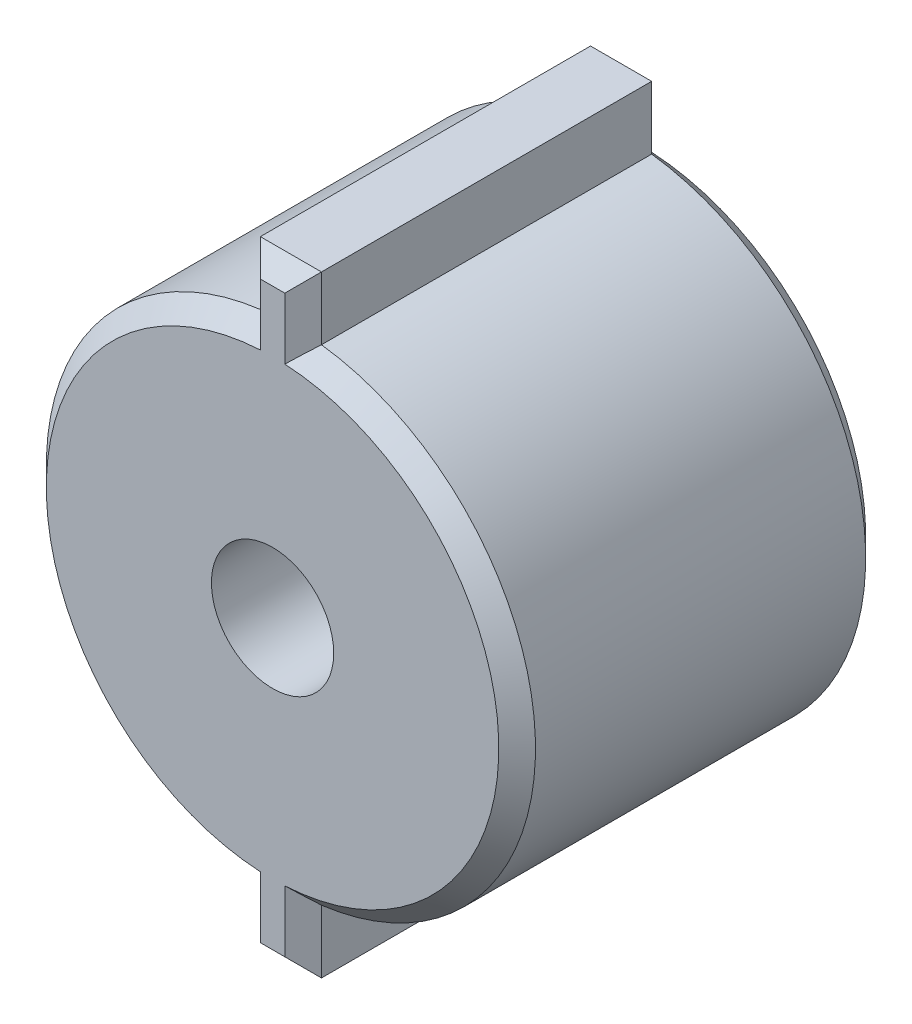
ISO-10303-21;
HEADER;
FILE_DESCRIPTION(('STEP AP214'),'2;1');
FILE_NAME('part.step','',(''),(''),'','','');
FILE_SCHEMA(('AUTOMOTIVE_DESIGN { 1 0 10303 214 1 1 1 1 }'));
ENDSEC;
DATA;
#1=APPLICATION_CONTEXT('core data for automotive mechanical design processes');
#2=APPLICATION_PROTOCOL_DEFINITION('international standard','automotive_design',2000,#1);
#3=PRODUCT_CONTEXT('',#1,'mechanical');
#4=PRODUCT('Part','Part','',(#3));
#5=PRODUCT_RELATED_PRODUCT_CATEGORY('part','',(#4));
#6=PRODUCT_DEFINITION_FORMATION('','',#4);
#7=PRODUCT_DEFINITION_CONTEXT('part definition',#1,'design');
#8=PRODUCT_DEFINITION('design','',#6,#7);
#9=PRODUCT_DEFINITION_SHAPE('','',#8);
#10=(LENGTH_UNIT() NAMED_UNIT(*) SI_UNIT(.MILLI.,.METRE.));
#11=(NAMED_UNIT(*) PLANE_ANGLE_UNIT() SI_UNIT($,.RADIAN.));
#12=(NAMED_UNIT(*) SI_UNIT($,.STERADIAN.) SOLID_ANGLE_UNIT());
#13=UNCERTAINTY_MEASURE_WITH_UNIT(LENGTH_MEASURE(1.E-05),#10,'distance_accuracy_value','');
#14=(GEOMETRIC_REPRESENTATION_CONTEXT(3) GLOBAL_UNCERTAINTY_ASSIGNED_CONTEXT((#13)) GLOBAL_UNIT_ASSIGNED_CONTEXT((#10,
#11,#12)) REPRESENTATION_CONTEXT('',''));
#15=CARTESIAN_POINT('',(0.,0.,0.));
#16=DIRECTION('',(0.,0.,1.));
#17=DIRECTION('',(1.,0.,0.));
#18=AXIS2_PLACEMENT_3D('',#15,#16,#17);
#19=CARTESIAN_POINT('',(0.,0.,1.5));
#20=DIRECTION('',(0.,0.,-1.));
#21=DIRECTION('',(-1.,0.,0.));
#22=AXIS2_PLACEMENT_3D('',#19,#20,#21);
#23=CYLINDRICAL_SURFACE('',#22,2.);
#24=DIRECTION('',(0.,0.,-1.));
#25=VECTOR('',#24,1.);
#26=CARTESIAN_POINT('',(-0.25,1.98431348329844,1.5));
#27=LINE('',#26,#25);
#28=CARTESIAN_POINT('',(-0.25,1.98431348329844,1.35));
#29=VERTEX_POINT('',#28);
#30=CARTESIAN_POINT('',(-0.25,1.98431348329844,-1.35));
#31=VERTEX_POINT('',#30);
#32=EDGE_CURVE('E472',#29,#31,#27,.T.);
#33=ORIENTED_EDGE('',*,*,#32,.T.);
#34=CARTESIAN_POINT('',(0.,0.,-1.35));
#35=DIRECTION('',(0.,0.,1.));
#36=DIRECTION('',(1.,0.,0.));
#37=AXIS2_PLACEMENT_3D('',#34,#35,#36);
#38=CIRCLE('',#37,2.);
#39=CARTESIAN_POINT('',(-0.25,-1.98431348329844,-1.35));
#40=VERTEX_POINT('',#39);
#41=EDGE_CURVE('E213',#31,#40,#38,.T.);
#42=ORIENTED_EDGE('',*,*,#41,.T.);
#43=DIRECTION('',(0.,0.,-1.));
#44=VECTOR('',#43,1.);
#45=CARTESIAN_POINT('',(-0.25,-1.98431348329844,1.5));
#46=LINE('',#45,#44);
#47=CARTESIAN_POINT('',(-0.25,-1.98431348329844,1.35));
#48=VERTEX_POINT('',#47);
#49=EDGE_CURVE('E171',#48,#40,#46,.T.);
#50=ORIENTED_EDGE('',*,*,#49,.F.);
#51=CARTESIAN_POINT('',(0.,0.,1.35));
#52=DIRECTION('',(0.,0.,1.));
#53=DIRECTION('',(1.,0.,0.));
#54=AXIS2_PLACEMENT_3D('',#51,#52,#53);
#55=CIRCLE('',#54,2.);
#56=EDGE_CURVE('E211',#48,#29,#55,.F.);
#57=ORIENTED_EDGE('',*,*,#56,.T.);
#58=EDGE_LOOP('',(#33,#42,#50,#57));
#59=FACE_BOUND('',#58,.T.);
#60=ADVANCED_FACE('F37',(#59),#23,.T.);
#61=CARTESIAN_POINT('',(-0.25,0.,1.5));
#62=DIRECTION('',(-1.,0.,0.));
#63=DIRECTION('',(0.,0.,1.));
#64=AXIS2_PLACEMENT_3D('',#61,#62,#63);
#65=PLANE('',#64);
#66=ORIENTED_EDGE('',*,*,#49,.T.);
#67=DIRECTION('',(0.,-1.,0.));
#68=VECTOR('',#67,1.);
#69=CARTESIAN_POINT('',(-0.25,-2.5,-1.35));
#70=LINE('',#69,#68);
#71=CARTESIAN_POINT('',(-0.25,-2.5,-1.35));
#72=VERTEX_POINT('',#71);
#73=EDGE_CURVE('E158',#40,#72,#70,.T.);
#74=ORIENTED_EDGE('',*,*,#73,.T.);
#75=DIRECTION('',(0.,0.,-1.));
#76=VECTOR('',#75,1.);
#77=CARTESIAN_POINT('',(-0.25,-2.5,1.5));
#78=LINE('',#77,#76);
#79=CARTESIAN_POINT('',(-0.25,-2.5,1.35));
#80=VERTEX_POINT('',#79);
#81=EDGE_CURVE('E413',#80,#72,#78,.T.);
#82=ORIENTED_EDGE('',*,*,#81,.F.);
#83=DIRECTION('',(0.,1.,0.));
#84=VECTOR('',#83,1.);
#85=CARTESIAN_POINT('',(-0.25,0.,1.35));
#86=LINE('',#85,#84);
#87=EDGE_CURVE('E178',#80,#48,#86,.T.);
#88=ORIENTED_EDGE('',*,*,#87,.T.);
#89=EDGE_LOOP('',(#66,#74,#82,#88));
#90=FACE_BOUND('',#89,.T.);
#91=ADVANCED_FACE('F416',(#90),#65,.T.);
#92=CARTESIAN_POINT('',(0.,-2.5,1.5));
#93=DIRECTION('',(0.,-1.,0.));
#94=DIRECTION('',(0.,0.,-1.));
#95=AXIS2_PLACEMENT_3D('',#92,#93,#94);
#96=PLANE('',#95);
#97=ORIENTED_EDGE('',*,*,#81,.T.);
#98=DIRECTION('',(1.,0.,0.));
#99=VECTOR('',#98,1.);
#100=CARTESIAN_POINT('',(0.25,-2.5,-1.35));
#101=LINE('',#100,#99);
#102=CARTESIAN_POINT('',(0.25,-2.5,-1.35));
#103=VERTEX_POINT('',#102);
#104=EDGE_CURVE('E188',#72,#103,#101,.T.);
#105=ORIENTED_EDGE('',*,*,#104,.T.);
#106=DIRECTION('',(0.,0.,-1.));
#107=VECTOR('',#106,1.);
#108=CARTESIAN_POINT('',(0.25,-2.5,1.5));
#109=LINE('',#108,#107);
#110=CARTESIAN_POINT('',(0.25,-2.5,1.35));
#111=VERTEX_POINT('',#110);
#112=EDGE_CURVE('E400',#111,#103,#109,.T.);
#113=ORIENTED_EDGE('',*,*,#112,.F.);
#114=DIRECTION('',(-1.,0.,0.));
#115=VECTOR('',#114,1.);
#116=CARTESIAN_POINT('',(0.,-2.5,1.35));
#117=LINE('',#116,#115);
#118=EDGE_CURVE('E186',#111,#80,#117,.T.);
#119=ORIENTED_EDGE('',*,*,#118,.T.);
#120=EDGE_LOOP('',(#97,#105,#113,#119));
#121=FACE_BOUND('',#120,.T.);
#122=ADVANCED_FACE('F412',(#121),#96,.T.);
#123=CARTESIAN_POINT('',(0.25,0.,1.5));
#124=DIRECTION('',(-1.,0.,0.));
#125=DIRECTION('',(0.,0.,1.));
#126=AXIS2_PLACEMENT_3D('',#123,#124,#125);
#127=PLANE('',#126);
#128=ORIENTED_EDGE('',*,*,#112,.T.);
#129=DIRECTION('',(0.,1.,0.));
#130=VECTOR('',#129,1.);
#131=CARTESIAN_POINT('',(0.25,0.,-1.35));
#132=LINE('',#131,#130);
#133=CARTESIAN_POINT('',(0.25,-1.98431348329844,-1.35));
#134=VERTEX_POINT('',#133);
#135=EDGE_CURVE('E192',#103,#134,#132,.T.);
#136=ORIENTED_EDGE('',*,*,#135,.T.);
#137=DIRECTION('',(0.,0.,-1.));
#138=VECTOR('',#137,1.);
#139=CARTESIAN_POINT('',(0.25,-1.98431348329844,1.5));
#140=LINE('',#139,#138);
#141=CARTESIAN_POINT('',(0.25,-1.98431348329844,1.35));
#142=VERTEX_POINT('',#141);
#143=EDGE_CURVE('E390',#142,#134,#140,.T.);
#144=ORIENTED_EDGE('',*,*,#143,.F.);
#145=DIRECTION('',(0.,-1.,0.));
#146=VECTOR('',#145,1.);
#147=CARTESIAN_POINT('',(0.25,-2.5,1.35));
#148=LINE('',#147,#146);
#149=EDGE_CURVE('E190',#142,#111,#148,.T.);
#150=ORIENTED_EDGE('',*,*,#149,.T.);
#151=EDGE_LOOP('',(#128,#136,#144,#150));
#152=FACE_BOUND('',#151,.T.);
#153=ADVANCED_FACE('F397',(#152),#127,.F.);
#154=CARTESIAN_POINT('',(0.,0.,1.5));
#155=DIRECTION('',(0.,0.,-1.));
#156=DIRECTION('',(-1.,0.,0.));
#157=AXIS2_PLACEMENT_3D('',#154,#155,#156);
#158=CYLINDRICAL_SURFACE('',#157,2.);
#159=ORIENTED_EDGE('',*,*,#143,.T.);
#160=CARTESIAN_POINT('',(0.,0.,-1.35));
#161=DIRECTION('',(0.,0.,1.));
#162=DIRECTION('',(1.,0.,0.));
#163=AXIS2_PLACEMENT_3D('',#160,#161,#162);
#164=CIRCLE('',#163,2.);
#165=CARTESIAN_POINT('',(0.25,1.98431348329844,-1.35));
#166=VERTEX_POINT('',#165);
#167=EDGE_CURVE('E196',#134,#166,#164,.T.);
#168=ORIENTED_EDGE('',*,*,#167,.T.);
#169=DIRECTION('',(0.,0.,-1.));
#170=VECTOR('',#169,1.);
#171=CARTESIAN_POINT('',(0.25,1.98431348329844,1.5));
#172=LINE('',#171,#170);
#173=CARTESIAN_POINT('',(0.25,1.98431348329844,1.35));
#174=VERTEX_POINT('',#173);
#175=EDGE_CURVE('E393',#174,#166,#172,.T.);
#176=ORIENTED_EDGE('',*,*,#175,.F.);
#177=CARTESIAN_POINT('',(0.,0.,1.35));
#178=DIRECTION('',(0.,0.,1.));
#179=DIRECTION('',(1.,0.,0.));
#180=AXIS2_PLACEMENT_3D('',#177,#178,#179);
#181=CIRCLE('',#180,2.);
#182=EDGE_CURVE('E194',#174,#142,#181,.F.);
#183=ORIENTED_EDGE('',*,*,#182,.T.);
#184=EDGE_LOOP('',(#159,#168,#176,#183));
#185=FACE_BOUND('',#184,.T.);
#186=ADVANCED_FACE('F389',(#185),#158,.T.);
#187=CARTESIAN_POINT('',(0.25,0.,1.5));
#188=DIRECTION('',(-1.,0.,0.));
#189=DIRECTION('',(0.,0.,1.));
#190=AXIS2_PLACEMENT_3D('',#187,#188,#189);
#191=PLANE('',#190);
#192=ORIENTED_EDGE('',*,*,#175,.T.);
#193=DIRECTION('',(0.,1.,0.));
#194=VECTOR('',#193,1.);
#195=CARTESIAN_POINT('',(0.25,0.,-1.35));
#196=LINE('',#195,#194);
#197=CARTESIAN_POINT('',(0.25,2.5,-1.35));
#198=VERTEX_POINT('',#197);
#199=EDGE_CURVE('E200',#166,#198,#196,.T.);
#200=ORIENTED_EDGE('',*,*,#199,.T.);
#201=DIRECTION('',(0.,0.,-1.));
#202=VECTOR('',#201,1.);
#203=CARTESIAN_POINT('',(0.25,2.5,1.5));
#204=LINE('',#203,#202);
#205=CARTESIAN_POINT('',(0.25,2.5,1.35));
#206=VERTEX_POINT('',#205);
#207=EDGE_CURVE('E479',#206,#198,#204,.T.);
#208=ORIENTED_EDGE('',*,*,#207,.F.);
#209=DIRECTION('',(0.,-1.,0.));
#210=VECTOR('',#209,1.);
#211=CARTESIAN_POINT('',(0.25,1.98431348329844,1.35));
#212=LINE('',#211,#210);
#213=EDGE_CURVE('E198',#206,#174,#212,.T.);
#214=ORIENTED_EDGE('',*,*,#213,.T.);
#215=EDGE_LOOP('',(#192,#200,#208,#214));
#216=FACE_BOUND('',#215,.T.);
#217=ADVANCED_FACE('F462',(#216),#191,.F.);
#218=CARTESIAN_POINT('',(0.,2.5,1.5));
#219=DIRECTION('',(0.,-1.,0.));
#220=DIRECTION('',(0.,0.,-1.));
#221=AXIS2_PLACEMENT_3D('',#218,#219,#220);
#222=PLANE('',#221);
#223=ORIENTED_EDGE('',*,*,#207,.T.);
#224=DIRECTION('',(-1.,0.,0.));
#225=VECTOR('',#224,1.);
#226=CARTESIAN_POINT('',(0.,2.5,-1.35));
#227=LINE('',#226,#225);
#228=CARTESIAN_POINT('',(-0.25,2.5,-1.35));
#229=VERTEX_POINT('',#228);
#230=EDGE_CURVE('E204',#198,#229,#227,.T.);
#231=ORIENTED_EDGE('',*,*,#230,.T.);
#232=DIRECTION('',(0.,0.,-1.));
#233=VECTOR('',#232,1.);
#234=CARTESIAN_POINT('',(-0.25,2.5,1.5));
#235=LINE('',#234,#233);
#236=CARTESIAN_POINT('',(-0.25,2.5,1.35));
#237=VERTEX_POINT('',#236);
#238=EDGE_CURVE('E476',#237,#229,#235,.T.);
#239=ORIENTED_EDGE('',*,*,#238,.F.);
#240=DIRECTION('',(1.,0.,0.));
#241=VECTOR('',#240,1.);
#242=CARTESIAN_POINT('',(0.25,2.5,1.35));
#243=LINE('',#242,#241);
#244=EDGE_CURVE('E202',#237,#206,#243,.T.);
#245=ORIENTED_EDGE('',*,*,#244,.T.);
#246=EDGE_LOOP('',(#223,#231,#239,#245));
#247=FACE_BOUND('',#246,.T.);
#248=ADVANCED_FACE('F453',(#247),#222,.F.);
#249=CARTESIAN_POINT('',(0.,0.,1.5));
#250=DIRECTION('',(0.,0.,-1.));
#251=DIRECTION('',(-1.,0.,0.));
#252=AXIS2_PLACEMENT_3D('',#249,#250,#251);
#253=CYLINDRICAL_SURFACE('',#252,0.5);
#254=CARTESIAN_POINT('',(0.,0.,1.5));
#255=DIRECTION('',(0.,0.,1.));
#256=DIRECTION('',(1.,0.,0.));
#257=AXIS2_PLACEMENT_3D('',#254,#255,#256);
#258=CIRCLE('',#257,0.5);
#259=CARTESIAN_POINT('',(0.5,0.,1.5));
#260=VERTEX_POINT('',#259);
#261=EDGE_CURVE('E468',#260,#260,#258,.T.);
#262=ORIENTED_EDGE('',*,*,#261,.T.);
#263=EDGE_LOOP('',(#262));
#264=FACE_BOUND('',#263,.T.);
#265=CARTESIAN_POINT('',(0.,0.,-1.5));
#266=DIRECTION('',(0.,0.,1.));
#267=DIRECTION('',(1.,0.,0.));
#268=AXIS2_PLACEMENT_3D('',#265,#266,#267);
#269=CIRCLE('',#268,0.5);
#270=CARTESIAN_POINT('',(0.5,0.,-1.5));
#271=VERTEX_POINT('',#270);
#272=EDGE_CURVE('E294',#271,#271,#269,.T.);
#273=ORIENTED_EDGE('',*,*,#272,.F.);
#274=EDGE_LOOP('',(#273));
#275=FACE_BOUND('',#274,.T.);
#276=ADVANCED_FACE('F450',(#264,#275),#253,.F.);
#277=CARTESIAN_POINT('',(-0.25,0.,1.5));
#278=DIRECTION('',(-1.,0.,0.));
#279=DIRECTION('',(0.,0.,1.));
#280=AXIS2_PLACEMENT_3D('',#277,#278,#279);
#281=PLANE('',#280);
#282=ORIENTED_EDGE('',*,*,#238,.T.);
#283=DIRECTION('',(0.,-1.,0.));
#284=VECTOR('',#283,1.);
#285=CARTESIAN_POINT('',(-0.25,1.98431348329844,-1.35));
#286=LINE('',#285,#284);
#287=EDGE_CURVE('E209',#229,#31,#286,.T.);
#288=ORIENTED_EDGE('',*,*,#287,.T.);
#289=ORIENTED_EDGE('',*,*,#32,.F.);
#290=DIRECTION('',(0.,1.,0.));
#291=VECTOR('',#290,1.);
#292=CARTESIAN_POINT('',(-0.25,0.,1.35));
#293=LINE('',#292,#291);
#294=EDGE_CURVE('E206',#29,#237,#293,.T.);
#295=ORIENTED_EDGE('',*,*,#294,.T.);
#296=EDGE_LOOP('',(#282,#288,#289,#295));
#297=FACE_BOUND('',#296,.T.);
#298=ADVANCED_FACE('F452',(#297),#281,.T.);
#299=CARTESIAN_POINT('',(0.,0.,1.5));
#300=DIRECTION('',(0.,0.,1.));
#301=DIRECTION('',(1.,0.,0.));
#302=AXIS2_PLACEMENT_3D('',#299,#300,#301);
#303=PLANE('',#302);
#304=DIRECTION('',(-1.,0.,0.));
#305=VECTOR('',#304,1.);
#306=CARTESIAN_POINT('',(-0.25,2.35,1.5));
#307=LINE('',#306,#305);
#308=CARTESIAN_POINT('',(0.0999999999999993,2.35,1.5));
#309=VERTEX_POINT('',#308);
#310=CARTESIAN_POINT('',(-0.0999999999999991,2.35,1.5));
#311=VERTEX_POINT('',#310);
#312=EDGE_CURVE('E47',#309,#311,#307,.T.);
#313=ORIENTED_EDGE('',*,*,#312,.T.);
#314=DIRECTION('',(0.,-1.,0.));
#315=VECTOR('',#314,1.);
#316=CARTESIAN_POINT('',(-0.0999999999999991,0.,1.5));
#317=LINE('',#316,#315);
#318=CARTESIAN_POINT('',(-0.0999999999999991,1.84729532019112,1.5));
#319=VERTEX_POINT('',#318);
#320=EDGE_CURVE('E11',#311,#319,#317,.T.);
#321=ORIENTED_EDGE('',*,*,#320,.T.);
#322=CARTESIAN_POINT('',(0.,0.,1.5));
#323=DIRECTION('',(0.,0.,1.));
#324=DIRECTION('',(1.,0.,0.));
#325=AXIS2_PLACEMENT_3D('',#322,#323,#324);
#326=CIRCLE('',#325,1.85);
#327=CARTESIAN_POINT('',(-0.0999999999999991,-1.84729532019112,1.5));
#328=VERTEX_POINT('',#327);
#329=EDGE_CURVE('E215',#319,#328,#326,.T.);
#330=ORIENTED_EDGE('',*,*,#329,.T.);
#331=DIRECTION('',(0.,-1.,0.));
#332=VECTOR('',#331,1.);
#333=CARTESIAN_POINT('',(-0.0999999999999991,0.,1.5));
#334=LINE('',#333,#332);
#335=CARTESIAN_POINT('',(-0.0999999999999991,-2.35,1.5));
#336=VERTEX_POINT('',#335);
#337=EDGE_CURVE('E217',#328,#336,#334,.T.);
#338=ORIENTED_EDGE('',*,*,#337,.T.);
#339=DIRECTION('',(1.,0.,0.));
#340=VECTOR('',#339,1.);
#341=CARTESIAN_POINT('',(0.,-2.35,1.5));
#342=LINE('',#341,#340);
#343=CARTESIAN_POINT('',(0.0999999999999993,-2.35,1.5));
#344=VERTEX_POINT('',#343);
#345=EDGE_CURVE('E219',#336,#344,#342,.T.);
#346=ORIENTED_EDGE('',*,*,#345,.T.);
#347=DIRECTION('',(0.,1.,0.));
#348=VECTOR('',#347,1.);
#349=CARTESIAN_POINT('',(0.0999999999999993,-1.98431348329844,1.5));
#350=LINE('',#349,#348);
#351=CARTESIAN_POINT('',(0.0999999999999993,-1.84729532019112,1.5));
#352=VERTEX_POINT('',#351);
#353=EDGE_CURVE('E221',#344,#352,#350,.T.);
#354=ORIENTED_EDGE('',*,*,#353,.T.);
#355=CARTESIAN_POINT('',(0.,0.,1.5));
#356=DIRECTION('',(0.,0.,1.));
#357=DIRECTION('',(1.,0.,0.));
#358=AXIS2_PLACEMENT_3D('',#355,#356,#357);
#359=CIRCLE('',#358,1.85);
#360=CARTESIAN_POINT('',(0.0999999999999993,1.84729532019112,1.5));
#361=VERTEX_POINT('',#360);
#362=EDGE_CURVE('E223',#352,#361,#359,.T.);
#363=ORIENTED_EDGE('',*,*,#362,.T.);
#364=DIRECTION('',(0.,1.,0.));
#365=VECTOR('',#364,1.);
#366=CARTESIAN_POINT('',(0.0999999999999993,2.5,1.5));
#367=LINE('',#366,#365);
#368=EDGE_CURVE('E58',#361,#309,#367,.T.);
#369=ORIENTED_EDGE('',*,*,#368,.T.);
#370=EDGE_LOOP('',(#313,#321,#330,#338,#346,#354,#363,#369));
#371=FACE_BOUND('',#370,.T.);
#372=ORIENTED_EDGE('',*,*,#261,.F.);
#373=EDGE_LOOP('',(#372));
#374=FACE_BOUND('',#373,.T.);
#375=ADVANCED_FACE('F459',(#371,#374),#303,.T.);
#376=CARTESIAN_POINT('',(0.,0.,-1.5));
#377=DIRECTION('',(0.,0.,1.));
#378=DIRECTION('',(1.,0.,0.));
#379=AXIS2_PLACEMENT_3D('',#376,#377,#378);
#380=PLANE('',#379);
#381=DIRECTION('',(-1.,0.,0.));
#382=VECTOR('',#381,1.);
#383=CARTESIAN_POINT('',(-0.25,-2.35,-1.5));
#384=LINE('',#383,#382);
#385=CARTESIAN_POINT('',(0.0999999999999993,-2.35,-1.5));
#386=VERTEX_POINT('',#385);
#387=CARTESIAN_POINT('',(-0.0999999999999991,-2.35,-1.5));
#388=VERTEX_POINT('',#387);
#389=EDGE_CURVE('E176',#386,#388,#384,.T.);
#390=ORIENTED_EDGE('',*,*,#389,.T.);
#391=DIRECTION('',(0.,1.,0.));
#392=VECTOR('',#391,1.);
#393=CARTESIAN_POINT('',(-0.0999999999999991,-1.98431348329844,-1.5));
#394=LINE('',#393,#392);
#395=CARTESIAN_POINT('',(-0.0999999999999991,-1.84729532019112,-1.5));
#396=VERTEX_POINT('',#395);
#397=EDGE_CURVE('E156',#388,#396,#394,.T.);
#398=ORIENTED_EDGE('',*,*,#397,.T.);
#399=CARTESIAN_POINT('',(0.,0.,-1.5));
#400=DIRECTION('',(0.,0.,1.));
#401=DIRECTION('',(1.,0.,0.));
#402=AXIS2_PLACEMENT_3D('',#399,#400,#401);
#403=CIRCLE('',#402,1.85);
#404=CARTESIAN_POINT('',(-0.0999999999999991,1.84729532019112,-1.5));
#405=VERTEX_POINT('',#404);
#406=EDGE_CURVE('E164',#396,#405,#403,.F.);
#407=ORIENTED_EDGE('',*,*,#406,.T.);
#408=DIRECTION('',(0.,1.,0.));
#409=VECTOR('',#408,1.);
#410=CARTESIAN_POINT('',(-0.0999999999999991,2.5,-1.5));
#411=LINE('',#410,#409);
#412=CARTESIAN_POINT('',(-0.0999999999999991,2.35,-1.5));
#413=VERTEX_POINT('',#412);
#414=EDGE_CURVE('E170',#405,#413,#411,.T.);
#415=ORIENTED_EDGE('',*,*,#414,.T.);
#416=DIRECTION('',(1.,0.,0.));
#417=VECTOR('',#416,1.);
#418=CARTESIAN_POINT('',(0.,2.35,-1.5));
#419=LINE('',#418,#417);
#420=CARTESIAN_POINT('',(0.0999999999999993,2.35,-1.5));
#421=VERTEX_POINT('',#420);
#422=EDGE_CURVE('E423',#413,#421,#419,.T.);
#423=ORIENTED_EDGE('',*,*,#422,.T.);
#424=DIRECTION('',(0.,-1.,0.));
#425=VECTOR('',#424,1.);
#426=CARTESIAN_POINT('',(0.0999999999999993,0.,-1.5));
#427=LINE('',#426,#425);
#428=CARTESIAN_POINT('',(0.0999999999999993,1.84729532019112,-1.5));
#429=VERTEX_POINT('',#428);
#430=EDGE_CURVE('E425',#421,#429,#427,.T.);
#431=ORIENTED_EDGE('',*,*,#430,.T.);
#432=CARTESIAN_POINT('',(0.,0.,-1.5));
#433=DIRECTION('',(0.,0.,1.));
#434=DIRECTION('',(1.,0.,0.));
#435=AXIS2_PLACEMENT_3D('',#432,#433,#434);
#436=CIRCLE('',#435,1.85);
#437=CARTESIAN_POINT('',(0.0999999999999993,-1.84729532019112,-1.5));
#438=VERTEX_POINT('',#437);
#439=EDGE_CURVE('E427',#429,#438,#436,.F.);
#440=ORIENTED_EDGE('',*,*,#439,.T.);
#441=DIRECTION('',(0.,-1.,0.));
#442=VECTOR('',#441,1.);
#443=CARTESIAN_POINT('',(0.0999999999999993,0.,-1.5));
#444=LINE('',#443,#442);
#445=EDGE_CURVE('E181',#438,#386,#444,.T.);
#446=ORIENTED_EDGE('',*,*,#445,.T.);
#447=EDGE_LOOP('',(#390,#398,#407,#415,#423,#431,#440,#446));
#448=FACE_BOUND('',#447,.T.);
#449=ORIENTED_EDGE('',*,*,#272,.T.);
#450=EDGE_LOOP('',(#449));
#451=FACE_BOUND('',#450,.T.);
#452=ADVANCED_FACE('F173',(#448,#451),#380,.F.);
#453=CARTESIAN_POINT('',(0.25,0.,-1.35));
#454=DIRECTION('',(-0.707106781186548,0.,0.707106781186548));
#455=DIRECTION('',(0.,1.,0.));
#456=AXIS2_PLACEMENT_3D('',#453,#454,#455);
#457=PLANE('',#456);
#458=DIRECTION('',(-0.577350269189626,-0.577350269189626,-0.577350269189626));
#459=VECTOR('',#458,1.);
#460=CARTESIAN_POINT('',(0.166666666666667,2.41666666666667,-1.43333333333333));
#461=LINE('',#460,#459);
#462=EDGE_CURVE('E269',#198,#421,#461,.T.);
#463=ORIENTED_EDGE('',*,*,#462,.F.);
#464=ORIENTED_EDGE('',*,*,#199,.F.);
#465=CARTESIAN_POINT('',(0.25,1.98431348329844,-1.35));
#466=CARTESIAN_POINT('',(0.224736929174509,1.96205331471373,-1.37526307082549));
#467=CARTESIAN_POINT('',(0.199605425772592,1.93950508045945,-1.40039457422741));
#468=CARTESIAN_POINT('',(0.14960542441054,1.89383236240588,-1.45039457558946));
#469=CARTESIAN_POINT('',(0.124736927812455,1.87070787562438,-1.47526307218754));
#470=CARTESIAN_POINT('',(0.0999999999999933,1.84729532019113,-1.50000000000001));
#471=B_SPLINE_CURVE_WITH_KNOTS('',3,(#465,#466,#467,#468,#469,#470),.UNSPECIFIED.,.F.,.F.,(4,2,
4),(0.,0.126271414620263,0.252543482850132),.UNSPECIFIED.);
#472=EDGE_CURVE('E287',#429,#166,#471,.F.);
#473=ORIENTED_EDGE('',*,*,#472,.F.);
#474=ORIENTED_EDGE('',*,*,#430,.F.);
#475=EDGE_LOOP('',(#463,#464,#473,#474));
#476=FACE_BOUND('',#475,.T.);
#477=ADVANCED_FACE('F283',(#476),#457,.F.);
#478=CARTESIAN_POINT('',(0.,0.,-1.35));
#479=DIRECTION('',(0.,0.,1.));
#480=DIRECTION('',(1.,0.,0.));
#481=AXIS2_PLACEMENT_3D('',#478,#479,#480);
#482=CONICAL_SURFACE('',#481,2.,0.785398163397448);
#483=ORIENTED_EDGE('',*,*,#472,.T.);
#484=ORIENTED_EDGE('',*,*,#167,.F.);
#485=CARTESIAN_POINT('',(0.25,-1.98431348329844,-1.35));
#486=CARTESIAN_POINT('',(0.224736929174509,-1.96205331471373,-1.37526307082549));
#487=CARTESIAN_POINT('',(0.199605425772592,-1.93950508045945,-1.40039457422741));
#488=CARTESIAN_POINT('',(0.14960542441054,-1.89383236240588,-1.45039457558946));
#489=CARTESIAN_POINT('',(0.124736927812455,-1.87070787562438,-1.47526307218754));
#490=CARTESIAN_POINT('',(0.0999999999999933,-1.84729532019113,-1.50000000000001));
#491=B_SPLINE_CURVE_WITH_KNOTS('',3,(#485,#486,#487,#488,#489,#490),.UNSPECIFIED.,.F.,.F.,(4,2,
4),(0.,0.126271414620263,0.252543482850132),.UNSPECIFIED.);
#492=EDGE_CURVE('E260',#438,#134,#491,.F.);
#493=ORIENTED_EDGE('',*,*,#492,.F.);
#494=ORIENTED_EDGE('',*,*,#439,.F.);
#495=EDGE_LOOP('',(#483,#484,#493,#494));
#496=FACE_BOUND('',#495,.T.);
#497=ADVANCED_FACE('F275',(#496),#482,.T.);
#498=CARTESIAN_POINT('',(0.,2.5,-1.35));
#499=DIRECTION('',(0.,-0.707106781186548,0.707106781186548));
#500=DIRECTION('',(-1.,0.,0.));
#501=AXIS2_PLACEMENT_3D('',#498,#499,#500);
#502=PLANE('',#501);
#503=ORIENTED_EDGE('',*,*,#462,.T.);
#504=ORIENTED_EDGE('',*,*,#422,.F.);
#505=DIRECTION('',(-0.577350269189626,0.577350269189626,0.577350269189626));
#506=VECTOR('',#505,1.);
#507=CARTESIAN_POINT('',(0.683333333333334,1.56666666666667,-2.28333333333333));
#508=LINE('',#507,#506);
#509=EDGE_CURVE('E257',#229,#413,#508,.F.);
#510=ORIENTED_EDGE('',*,*,#509,.F.);
#511=ORIENTED_EDGE('',*,*,#230,.F.);
#512=EDGE_LOOP('',(#503,#504,#510,#511));
#513=FACE_BOUND('',#512,.T.);
#514=ADVANCED_FACE('F282',(#513),#502,.F.);
#515=CARTESIAN_POINT('',(0.25,0.,-1.35));
#516=DIRECTION('',(-0.707106781186548,0.,0.707106781186548));
#517=DIRECTION('',(0.,1.,0.));
#518=AXIS2_PLACEMENT_3D('',#515,#516,#517);
#519=PLANE('',#518);
#520=ORIENTED_EDGE('',*,*,#492,.T.);
#521=ORIENTED_EDGE('',*,*,#135,.F.);
#522=DIRECTION('',(0.577350269189626,-0.577350269189626,0.577350269189626));
#523=VECTOR('',#522,1.);
#524=CARTESIAN_POINT('',(-0.583333333333333,-1.66666666666667,-2.18333333333333));
#525=LINE('',#524,#523);
#526=EDGE_CURVE('E254',#386,#103,#525,.T.);
#527=ORIENTED_EDGE('',*,*,#526,.F.);
#528=ORIENTED_EDGE('',*,*,#445,.F.);
#529=EDGE_LOOP('',(#520,#521,#527,#528));
#530=FACE_BOUND('',#529,.T.);
#531=ADVANCED_FACE('F272',(#530),#519,.F.);
#532=CARTESIAN_POINT('',(-0.0999999999999991,0.,-1.5));
#533=DIRECTION('',(-0.707106781186548,0.,-0.707106781186548));
#534=DIRECTION('',(0.,-1.,0.));
#535=AXIS2_PLACEMENT_3D('',#532,#533,#534);
#536=PLANE('',#535);
#537=ORIENTED_EDGE('',*,*,#509,.T.);
#538=ORIENTED_EDGE('',*,*,#414,.F.);
#539=CARTESIAN_POINT('',(-0.25,1.98431348329844,-1.35));
#540=CARTESIAN_POINT('',(-0.224736929174509,1.96205331471373,-1.37526307082549));
#541=CARTESIAN_POINT('',(-0.199605425772592,1.93950508045945,-1.40039457422741));
#542=CARTESIAN_POINT('',(-0.14960542441054,1.89383236240588,-1.45039457558946));
#543=CARTESIAN_POINT('',(-0.124736927812455,1.87070787562438,-1.47526307218754));
#544=CARTESIAN_POINT('',(-0.099999999999993,1.84729532019113,-1.50000000000001));
#545=B_SPLINE_CURVE_WITH_KNOTS('',3,(#539,#540,#541,#542,#543,#544),.UNSPECIFIED.,.F.,.F.,(4,2,
4),(0.,0.126271414620263,0.252543482850132),.UNSPECIFIED.);
#546=EDGE_CURVE('E167',#31,#405,#545,.T.);
#547=ORIENTED_EDGE('',*,*,#546,.F.);
#548=ORIENTED_EDGE('',*,*,#287,.F.);
#549=EDGE_LOOP('',(#537,#538,#547,#548));
#550=FACE_BOUND('',#549,.T.);
#551=ADVANCED_FACE('F245',(#550),#536,.T.);
#552=CARTESIAN_POINT('',(0.,-2.35,-1.5));
#553=DIRECTION('',(0.,-0.707106781186548,-0.707106781186548));
#554=DIRECTION('',(1.,0.,0.));
#555=AXIS2_PLACEMENT_3D('',#552,#553,#554);
#556=PLANE('',#555);
#557=ORIENTED_EDGE('',*,*,#526,.T.);
#558=ORIENTED_EDGE('',*,*,#104,.F.);
#559=DIRECTION('',(0.577350269189626,0.577350269189626,-0.577350269189626));
#560=VECTOR('',#559,1.);
#561=CARTESIAN_POINT('',(-0.066666666666666,-2.31666666666667,-1.53333333333333));
#562=LINE('',#561,#560);
#563=EDGE_CURVE('E161',#388,#72,#562,.F.);
#564=ORIENTED_EDGE('',*,*,#563,.F.);
#565=ORIENTED_EDGE('',*,*,#389,.F.);
#566=EDGE_LOOP('',(#557,#558,#564,#565));
#567=FACE_BOUND('',#566,.T.);
#568=ADVANCED_FACE('F244',(#567),#556,.T.);
#569=CARTESIAN_POINT('',(0.,0.,-1.35));
#570=DIRECTION('',(0.,0.,1.));
#571=DIRECTION('',(1.,0.,0.));
#572=AXIS2_PLACEMENT_3D('',#569,#570,#571);
#573=CONICAL_SURFACE('',#572,2.,0.785398163397448);
#574=ORIENTED_EDGE('',*,*,#546,.T.);
#575=ORIENTED_EDGE('',*,*,#406,.F.);
#576=CARTESIAN_POINT('',(-0.0999999999999991,-1.84729532019112,-1.5));
#577=CARTESIAN_POINT('',(-0.124736927812461,-1.87070787562437,-1.47526307218754));
#578=CARTESIAN_POINT('',(-0.149605424410544,-1.89383236240587,-1.45039457558946));
#579=CARTESIAN_POINT('',(-0.199605425772587,-1.93950508045946,-1.40039457422741));
#580=CARTESIAN_POINT('',(-0.224736929174499,-1.96205331471375,-1.3752630708255));
#581=CARTESIAN_POINT('',(-0.249999999999982,-1.98431348329848,-1.35000000000002));
#582=B_SPLINE_CURVE_WITH_KNOTS('',3,(#576,#577,#578,#579,#580,#581),.UNSPECIFIED.,.F.,.F.,(4,2,
4),(0.,0.126272068229869,0.252543482850131),.UNSPECIFIED.);
#583=EDGE_CURVE('E152',#40,#396,#582,.F.);
#584=ORIENTED_EDGE('',*,*,#583,.F.);
#585=ORIENTED_EDGE('',*,*,#41,.F.);
#586=EDGE_LOOP('',(#574,#575,#584,#585));
#587=FACE_BOUND('',#586,.T.);
#588=ADVANCED_FACE('F165',(#587),#573,.T.);
#589=CARTESIAN_POINT('',(-0.0999999999999991,0.,-1.5));
#590=DIRECTION('',(-0.707106781186548,0.,-0.707106781186548));
#591=DIRECTION('',(0.,-1.,0.));
#592=AXIS2_PLACEMENT_3D('',#589,#590,#591);
#593=PLANE('',#592);
#594=ORIENTED_EDGE('',*,*,#563,.T.);
#595=ORIENTED_EDGE('',*,*,#73,.F.);
#596=ORIENTED_EDGE('',*,*,#583,.T.);
#597=ORIENTED_EDGE('',*,*,#397,.F.);
#598=EDGE_LOOP('',(#594,#595,#596,#597));
#599=FACE_BOUND('',#598,.T.);
#600=ADVANCED_FACE('F154',(#599),#593,.T.);
#601=CARTESIAN_POINT('',(0.0999999999999993,0.,1.5));
#602=DIRECTION('',(0.70710678118655,0.,0.707106781186545));
#603=DIRECTION('',(0.,-1.,0.));
#604=AXIS2_PLACEMENT_3D('',#601,#602,#603);
#605=PLANE('',#604);
#606=CARTESIAN_POINT('',(0.25,-1.98431348329844,1.35));
#607=CARTESIAN_POINT('',(0.224736929174509,-1.96205331471373,1.37526307082549));
#608=CARTESIAN_POINT('',(0.199605425772592,-1.93950508045945,1.40039457422741));
#609=CARTESIAN_POINT('',(0.14960542441054,-1.89383236240588,1.45039457558946));
#610=CARTESIAN_POINT('',(0.124736927812455,-1.87070787562438,1.47526307218754));
#611=CARTESIAN_POINT('',(0.0999999999999933,-1.84729532019113,1.50000000000001));
#612=B_SPLINE_CURVE_WITH_KNOTS('',3,(#606,#607,#608,#609,#610,#611),.UNSPECIFIED.,.F.,.F.,(4,2,
4),(0.,0.126271414620264,0.252543482850132),.UNSPECIFIED.);
#613=EDGE_CURVE('E368',#352,#142,#612,.F.);
#614=ORIENTED_EDGE('',*,*,#613,.F.);
#615=ORIENTED_EDGE('',*,*,#353,.F.);
#616=DIRECTION('',(0.577350269189625,-0.577350269189625,-0.577350269189628));
#617=VECTOR('',#616,1.);
#618=CARTESIAN_POINT('',(0.166666666666667,-2.41666666666667,1.43333333333333));
#619=LINE('',#618,#617);
#620=EDGE_CURVE('E42',#111,#344,#619,.F.);
#621=ORIENTED_EDGE('',*,*,#620,.F.);
#622=ORIENTED_EDGE('',*,*,#149,.F.);
#623=EDGE_LOOP('',(#614,#615,#621,#622));
#624=FACE_BOUND('',#623,.T.);
#625=ADVANCED_FACE('F365',(#624),#605,.T.);
#626=CARTESIAN_POINT('',(0.,-2.5,1.35));
#627=DIRECTION('',(0.,0.70710678118655,-0.707106781186545));
#628=DIRECTION('',(-1.,0.,0.));
#629=AXIS2_PLACEMENT_3D('',#626,#627,#628);
#630=PLANE('',#629);
#631=ORIENTED_EDGE('',*,*,#620,.T.);
#632=ORIENTED_EDGE('',*,*,#345,.F.);
#633=DIRECTION('',(0.577350269189625,0.577350269189625,0.577350269189628));
#634=VECTOR('',#633,1.);
#635=CARTESIAN_POINT('',(0.58333333333333,-1.66666666666667,2.18333333333333));
#636=LINE('',#635,#634);
#637=EDGE_CURVE('E374',#80,#336,#636,.T.);
#638=ORIENTED_EDGE('',*,*,#637,.F.);
#639=ORIENTED_EDGE('',*,*,#118,.F.);
#640=EDGE_LOOP('',(#631,#632,#638,#639));
#641=FACE_BOUND('',#640,.T.);
#642=ADVANCED_FACE('F40',(#641),#630,.F.);
#643=CARTESIAN_POINT('',(0.,0.,1.5));
#644=DIRECTION('',(0.,0.,-1.));
#645=DIRECTION('',(-1.,0.,0.));
#646=AXIS2_PLACEMENT_3D('',#643,#644,#645);
#647=CONICAL_SURFACE('',#646,1.85,0.785398163397445);
#648=ORIENTED_EDGE('',*,*,#613,.T.);
#649=ORIENTED_EDGE('',*,*,#182,.F.);
#650=CARTESIAN_POINT('',(0.25,1.98431348329844,1.35));
#651=CARTESIAN_POINT('',(0.224736929174509,1.96205331471373,1.37526307082549));
#652=CARTESIAN_POINT('',(0.199605425772592,1.93950508045945,1.40039457422741));
#653=CARTESIAN_POINT('',(0.14960542441054,1.89383236240588,1.45039457558946));
#654=CARTESIAN_POINT('',(0.124736927812455,1.87070787562438,1.47526307218754));
#655=CARTESIAN_POINT('',(0.0999999999999933,1.84729532019113,1.50000000000001));
#656=B_SPLINE_CURVE_WITH_KNOTS('',3,(#650,#651,#652,#653,#654,#655),.UNSPECIFIED.,.F.,.F.,(4,2,
4),(0.,0.126271414620264,0.252543482850133),.UNSPECIFIED.);
#657=EDGE_CURVE('E334',#361,#174,#656,.F.);
#658=ORIENTED_EDGE('',*,*,#657,.F.);
#659=ORIENTED_EDGE('',*,*,#362,.F.);
#660=EDGE_LOOP('',(#648,#649,#658,#659));
#661=FACE_BOUND('',#660,.T.);
#662=ADVANCED_FACE('F351',(#661),#647,.T.);
#663=CARTESIAN_POINT('',(-0.25,0.,1.35));
#664=DIRECTION('',(0.70710678118655,0.,-0.707106781186545));
#665=DIRECTION('',(0.,1.,0.));
#666=AXIS2_PLACEMENT_3D('',#663,#664,#665);
#667=PLANE('',#666);
#668=ORIENTED_EDGE('',*,*,#637,.T.);
#669=ORIENTED_EDGE('',*,*,#337,.F.);
#670=CARTESIAN_POINT('',(-0.25,-1.98431348329844,1.35));
#671=CARTESIAN_POINT('',(-0.224736929174509,-1.96205331471373,1.37526307082549));
#672=CARTESIAN_POINT('',(-0.199605425772592,-1.93950508045945,1.40039457422741));
#673=CARTESIAN_POINT('',(-0.14960542441054,-1.89383236240588,1.45039457558946));
#674=CARTESIAN_POINT('',(-0.124736927812455,-1.87070787562438,1.47526307218754));
#675=CARTESIAN_POINT('',(-0.0999999999999931,-1.84729532019113,1.50000000000001));
#676=B_SPLINE_CURVE_WITH_KNOTS('',3,(#670,#671,#672,#673,#674,#675),.UNSPECIFIED.,.F.,.F.,(4,2,
4),(0.,0.126271414620264,0.252543482850132),.UNSPECIFIED.);
#677=EDGE_CURVE('E326',#48,#328,#676,.T.);
#678=ORIENTED_EDGE('',*,*,#677,.F.);
#679=ORIENTED_EDGE('',*,*,#87,.F.);
#680=EDGE_LOOP('',(#668,#669,#678,#679));
#681=FACE_BOUND('',#680,.T.);
#682=ADVANCED_FACE('F343',(#681),#667,.F.);
#683=CARTESIAN_POINT('',(0.0999999999999993,0.,1.5));
#684=DIRECTION('',(0.70710678118655,0.,0.707106781186545));
#685=DIRECTION('',(0.,-1.,0.));
#686=AXIS2_PLACEMENT_3D('',#683,#684,#685);
#687=PLANE('',#686);
#688=ORIENTED_EDGE('',*,*,#657,.T.);
#689=ORIENTED_EDGE('',*,*,#213,.F.);
#690=DIRECTION('',(-0.577350269189625,-0.577350269189625,0.577350269189628));
#691=VECTOR('',#690,1.);
#692=CARTESIAN_POINT('',(-0.683333333333331,1.56666666666667,2.28333333333333));
#693=LINE('',#692,#691);
#694=EDGE_CURVE('E323',#309,#206,#693,.F.);
#695=ORIENTED_EDGE('',*,*,#694,.F.);
#696=ORIENTED_EDGE('',*,*,#368,.F.);
#697=EDGE_LOOP('',(#688,#689,#695,#696));
#698=FACE_BOUND('',#697,.T.);
#699=ADVANCED_FACE('F350',(#698),#687,.T.);
#700=CARTESIAN_POINT('',(0.,0.,1.5));
#701=DIRECTION('',(0.,0.,-1.));
#702=DIRECTION('',(-1.,0.,0.));
#703=AXIS2_PLACEMENT_3D('',#700,#701,#702);
#704=CONICAL_SURFACE('',#703,1.85,0.785398163397445);
#705=ORIENTED_EDGE('',*,*,#677,.T.);
#706=ORIENTED_EDGE('',*,*,#329,.F.);
#707=CARTESIAN_POINT('',(-0.0999999999999991,1.84729532019112,1.5));
#708=CARTESIAN_POINT('',(-0.124736927812461,1.87070787562437,1.47526307218754));
#709=CARTESIAN_POINT('',(-0.149605424410544,1.89383236240587,1.45039457558945));
#710=CARTESIAN_POINT('',(-0.199605425772587,1.93950508045946,1.40039457422741));
#711=CARTESIAN_POINT('',(-0.224736929174499,1.96205331471375,1.3752630708255));
#712=CARTESIAN_POINT('',(-0.249999999999982,1.98431348329848,1.35000000000002));
#713=B_SPLINE_CURVE_WITH_KNOTS('',3,(#707,#708,#709,#710,#711,#712),.UNSPECIFIED.,.F.,.F.,(4,2,
4),(0.,0.126272068229869,0.252543482850132),.UNSPECIFIED.);
#714=EDGE_CURVE('E317',#29,#319,#713,.F.);
#715=ORIENTED_EDGE('',*,*,#714,.F.);
#716=ORIENTED_EDGE('',*,*,#56,.F.);
#717=EDGE_LOOP('',(#705,#706,#715,#716));
#718=FACE_BOUND('',#717,.T.);
#719=ADVANCED_FACE('F314',(#718),#704,.T.);
#720=CARTESIAN_POINT('',(0.,2.35,1.5));
#721=DIRECTION('',(0.,0.70710678118655,0.707106781186545));
#722=DIRECTION('',(1.,0.,0.));
#723=AXIS2_PLACEMENT_3D('',#720,#721,#722);
#724=PLANE('',#723);
#725=ORIENTED_EDGE('',*,*,#694,.T.);
#726=ORIENTED_EDGE('',*,*,#244,.F.);
#727=DIRECTION('',(-0.577350269189625,0.577350269189625,-0.577350269189628));
#728=VECTOR('',#727,1.);
#729=CARTESIAN_POINT('',(-0.0666666666666662,2.31666666666667,1.53333333333333));
#730=LINE('',#729,#728);
#731=EDGE_CURVE('E295',#311,#237,#730,.T.);
#732=ORIENTED_EDGE('',*,*,#731,.F.);
#733=ORIENTED_EDGE('',*,*,#312,.F.);
#734=EDGE_LOOP('',(#725,#726,#732,#733));
#735=FACE_BOUND('',#734,.T.);
#736=ADVANCED_FACE('F312',(#735),#724,.T.);
#737=CARTESIAN_POINT('',(-0.25,0.,1.35));
#738=DIRECTION('',(0.70710678118655,0.,-0.707106781186545));
#739=DIRECTION('',(0.,1.,0.));
#740=AXIS2_PLACEMENT_3D('',#737,#738,#739);
#741=PLANE('',#740);
#742=ORIENTED_EDGE('',*,*,#714,.T.);
#743=ORIENTED_EDGE('',*,*,#320,.F.);
#744=ORIENTED_EDGE('',*,*,#731,.T.);
#745=ORIENTED_EDGE('',*,*,#294,.F.);
#746=EDGE_LOOP('',(#742,#743,#744,#745));
#747=FACE_BOUND('',#746,.T.);
#748=ADVANCED_FACE('F305',(#747),#741,.F.);
#749=CLOSED_SHELL('',(#60,#91,#122,#153,#186,#217,#248,#276,#298,#375,#452,#477,#497,#514,#531,
#551,#568,#588,#600,#625,#642,#662,#682,#699,#719,#736,#748));
#750=MANIFOLD_SOLID_BREP('B2',#749);
#751=ADVANCED_BREP_SHAPE_REPRESENTATION('',(#18,#750),#14);
#752=SHAPE_DEFINITION_REPRESENTATION(#9,#751);
ENDSEC;
END-ISO-10303-21;
